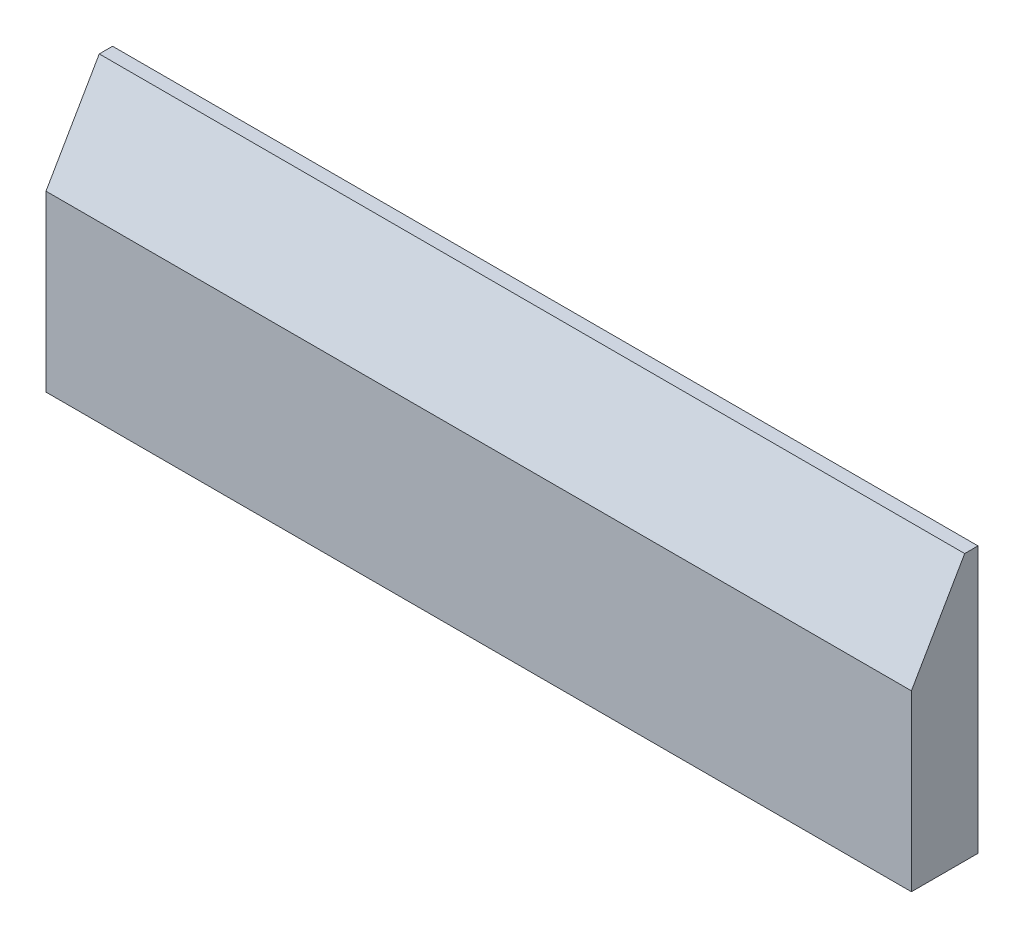
ISO-10303-21;
HEADER;
FILE_DESCRIPTION(('STEP AP214'),'2;1');
FILE_NAME('part.step','',(''),(''),'','','');
FILE_SCHEMA(('AUTOMOTIVE_DESIGN { 1 0 10303 214 1 1 1 1 }'));
ENDSEC;
DATA;
#1=APPLICATION_CONTEXT('core data for automotive mechanical design processes');
#2=APPLICATION_PROTOCOL_DEFINITION('international standard','automotive_design',2000,#1);
#3=PRODUCT_CONTEXT('',#1,'mechanical');
#4=PRODUCT('Part','Part','',(#3));
#5=PRODUCT_RELATED_PRODUCT_CATEGORY('part','',(#4));
#6=PRODUCT_DEFINITION_FORMATION('','',#4);
#7=PRODUCT_DEFINITION_CONTEXT('part definition',#1,'design');
#8=PRODUCT_DEFINITION('design','',#6,#7);
#9=PRODUCT_DEFINITION_SHAPE('','',#8);
#10=(LENGTH_UNIT() NAMED_UNIT(*) SI_UNIT(.MILLI.,.METRE.));
#11=(NAMED_UNIT(*) PLANE_ANGLE_UNIT() SI_UNIT($,.RADIAN.));
#12=(NAMED_UNIT(*) SI_UNIT($,.STERADIAN.) SOLID_ANGLE_UNIT());
#13=UNCERTAINTY_MEASURE_WITH_UNIT(LENGTH_MEASURE(1.E-05),#10,'distance_accuracy_value','');
#14=(GEOMETRIC_REPRESENTATION_CONTEXT(3) GLOBAL_UNCERTAINTY_ASSIGNED_CONTEXT((#13)) GLOBAL_UNIT_ASSIGNED_CONTEXT((#10,
#11,#12)) REPRESENTATION_CONTEXT('',''));
#15=CARTESIAN_POINT('',(0.,0.,0.));
#16=DIRECTION('',(0.,0.,1.));
#17=DIRECTION('',(1.,0.,0.));
#18=AXIS2_PLACEMENT_3D('',#15,#16,#17);
#19=CARTESIAN_POINT('',(0.,0.,6.35));
#20=DIRECTION('',(1.,0.,0.));
#21=DIRECTION('',(0.,0.,-1.));
#22=AXIS2_PLACEMENT_3D('',#19,#20,#21);
#23=PLANE('',#22);
#24=DIRECTION('',(0.,-1.,0.));
#25=VECTOR('',#24,1.);
#26=CARTESIAN_POINT('',(0.,0.,6.35));
#27=LINE('',#26,#25);
#28=CARTESIAN_POINT('',(0.,16.6011818975501,6.35));
#29=VERTEX_POINT('',#28);
#30=CARTESIAN_POINT('',(0.,0.,6.35));
#31=VERTEX_POINT('',#30);
#32=EDGE_CURVE('E77',#29,#31,#27,.T.);
#33=ORIENTED_EDGE('',*,*,#32,.F.);
#34=DIRECTION('',(0.,-0.866025403784438,0.500000000000001));
#35=VECTOR('',#34,1.);
#36=CARTESIAN_POINT('',(0.,16.6011818975501,6.35));
#37=LINE('',#36,#35);
#38=CARTESIAN_POINT('',(0.,25.4,1.26999999999999));
#39=VERTEX_POINT('',#38);
#40=EDGE_CURVE('E55',#29,#39,#37,.F.);
#41=ORIENTED_EDGE('',*,*,#40,.T.);
#42=DIRECTION('',(0.,0.,-1.));
#43=VECTOR('',#42,1.);
#44=CARTESIAN_POINT('',(0.,25.4,6.35));
#45=LINE('',#44,#43);
#46=CARTESIAN_POINT('',(0.,25.4,0.));
#47=VERTEX_POINT('',#46);
#48=EDGE_CURVE('E107',#39,#47,#45,.T.);
#49=ORIENTED_EDGE('',*,*,#48,.T.);
#50=DIRECTION('',(0.,-1.,0.));
#51=VECTOR('',#50,1.);
#52=CARTESIAN_POINT('',(0.,0.,0.));
#53=LINE('',#52,#51);
#54=CARTESIAN_POINT('',(0.,0.,0.));
#55=VERTEX_POINT('',#54);
#56=EDGE_CURVE('E99',#47,#55,#53,.T.);
#57=ORIENTED_EDGE('',*,*,#56,.T.);
#58=DIRECTION('',(0.,0.,-1.));
#59=VECTOR('',#58,1.);
#60=CARTESIAN_POINT('',(0.,0.,6.35));
#61=LINE('',#60,#59);
#62=EDGE_CURVE('E91',#31,#55,#61,.T.);
#63=ORIENTED_EDGE('',*,*,#62,.F.);
#64=EDGE_LOOP('',(#33,#41,#49,#57,#63));
#65=FACE_BOUND('',#64,.T.);
#66=ADVANCED_FACE('F33',(#65),#23,.F.);
#67=CARTESIAN_POINT('',(0.,0.,6.35));
#68=DIRECTION('',(0.,1.,0.));
#69=DIRECTION('',(0.,0.,1.));
#70=AXIS2_PLACEMENT_3D('',#67,#68,#69);
#71=PLANE('',#70);
#72=DIRECTION('',(1.,0.,0.));
#73=VECTOR('',#72,1.);
#74=CARTESIAN_POINT('',(0.,0.,0.));
#75=LINE('',#74,#73);
#76=CARTESIAN_POINT('',(82.55,0.,0.));
#77=VERTEX_POINT('',#76);
#78=EDGE_CURVE('E114',#55,#77,#75,.T.);
#79=ORIENTED_EDGE('',*,*,#78,.T.);
#80=DIRECTION('',(0.,0.,-1.));
#81=VECTOR('',#80,1.);
#82=CARTESIAN_POINT('',(82.55,0.,6.35));
#83=LINE('',#82,#81);
#84=CARTESIAN_POINT('',(82.55,0.,6.35));
#85=VERTEX_POINT('',#84);
#86=EDGE_CURVE('E94',#85,#77,#83,.T.);
#87=ORIENTED_EDGE('',*,*,#86,.F.);
#88=DIRECTION('',(1.,0.,0.));
#89=VECTOR('',#88,1.);
#90=CARTESIAN_POINT('',(0.,0.,6.35));
#91=LINE('',#90,#89);
#92=EDGE_CURVE('E81',#31,#85,#91,.T.);
#93=ORIENTED_EDGE('',*,*,#92,.F.);
#94=ORIENTED_EDGE('',*,*,#62,.T.);
#95=EDGE_LOOP('',(#79,#87,#93,#94));
#96=FACE_BOUND('',#95,.T.);
#97=ADVANCED_FACE('F90',(#96),#71,.F.);
#98=CARTESIAN_POINT('',(82.55,0.,6.35));
#99=DIRECTION('',(-1.,0.,0.));
#100=DIRECTION('',(0.,0.,1.));
#101=AXIS2_PLACEMENT_3D('',#98,#99,#100);
#102=PLANE('',#101);
#103=DIRECTION('',(0.,0.,-1.));
#104=VECTOR('',#103,1.);
#105=CARTESIAN_POINT('',(82.55,25.4,6.35));
#106=LINE('',#105,#104);
#107=CARTESIAN_POINT('',(82.55,25.4,1.26999999999999));
#108=VERTEX_POINT('',#107);
#109=CARTESIAN_POINT('',(82.55,25.4,0.));
#110=VERTEX_POINT('',#109);
#111=EDGE_CURVE('E102',#108,#110,#106,.T.);
#112=ORIENTED_EDGE('',*,*,#111,.F.);
#113=DIRECTION('',(0.,0.866025403784438,-0.500000000000001));
#114=VECTOR('',#113,1.);
#115=CARTESIAN_POINT('',(82.55,16.6011818975501,6.35));
#116=LINE('',#115,#114);
#117=CARTESIAN_POINT('',(82.55,16.6011818975501,6.35));
#118=VERTEX_POINT('',#117);
#119=EDGE_CURVE('E11',#108,#118,#116,.F.);
#120=ORIENTED_EDGE('',*,*,#119,.T.);
#121=DIRECTION('',(0.,1.,0.));
#122=VECTOR('',#121,1.);
#123=CARTESIAN_POINT('',(82.55,0.,6.35));
#124=LINE('',#123,#122);
#125=EDGE_CURVE('E96',#85,#118,#124,.T.);
#126=ORIENTED_EDGE('',*,*,#125,.F.);
#127=ORIENTED_EDGE('',*,*,#86,.T.);
#128=DIRECTION('',(0.,1.,0.));
#129=VECTOR('',#128,1.);
#130=CARTESIAN_POINT('',(82.55,0.,0.));
#131=LINE('',#130,#129);
#132=EDGE_CURVE('E111',#77,#110,#131,.T.);
#133=ORIENTED_EDGE('',*,*,#132,.T.);
#134=EDGE_LOOP('',(#112,#120,#126,#127,#133));
#135=FACE_BOUND('',#134,.T.);
#136=ADVANCED_FACE('F120',(#135),#102,.F.);
#137=CARTESIAN_POINT('',(0.,25.4,6.35));
#138=DIRECTION('',(0.,-1.,0.));
#139=DIRECTION('',(0.,0.,-1.));
#140=AXIS2_PLACEMENT_3D('',#137,#138,#139);
#141=PLANE('',#140);
#142=ORIENTED_EDGE('',*,*,#48,.F.);
#143=DIRECTION('',(1.,0.,0.));
#144=VECTOR('',#143,1.);
#145=CARTESIAN_POINT('',(0.,25.4,1.26999999999999));
#146=LINE('',#145,#144);
#147=EDGE_CURVE('E41',#39,#108,#146,.T.);
#148=ORIENTED_EDGE('',*,*,#147,.T.);
#149=ORIENTED_EDGE('',*,*,#111,.T.);
#150=DIRECTION('',(-1.,0.,0.));
#151=VECTOR('',#150,1.);
#152=CARTESIAN_POINT('',(0.,25.4,0.));
#153=LINE('',#152,#151);
#154=EDGE_CURVE('E86',#110,#47,#153,.T.);
#155=ORIENTED_EDGE('',*,*,#154,.T.);
#156=EDGE_LOOP('',(#142,#148,#149,#155));
#157=FACE_BOUND('',#156,.T.);
#158=ADVANCED_FACE('F123',(#157),#141,.F.);
#159=CARTESIAN_POINT('',(0.,0.,6.35));
#160=DIRECTION('',(0.,0.,-1.));
#161=DIRECTION('',(-1.,0.,0.));
#162=AXIS2_PLACEMENT_3D('',#159,#160,#161);
#163=PLANE('',#162);
#164=ORIENTED_EDGE('',*,*,#125,.T.);
#165=DIRECTION('',(-1.,0.,0.));
#166=VECTOR('',#165,1.);
#167=CARTESIAN_POINT('',(0.,16.6011818975501,6.35));
#168=LINE('',#167,#166);
#169=EDGE_CURVE('E84',#118,#29,#168,.T.);
#170=ORIENTED_EDGE('',*,*,#169,.T.);
#171=ORIENTED_EDGE('',*,*,#32,.T.);
#172=ORIENTED_EDGE('',*,*,#92,.T.);
#173=EDGE_LOOP('',(#164,#170,#171,#172));
#174=FACE_BOUND('',#173,.T.);
#175=ADVANCED_FACE('F80',(#174),#163,.F.);
#176=CARTESIAN_POINT('',(0.,0.,0.));
#177=DIRECTION('',(0.,0.,-1.));
#178=DIRECTION('',(-1.,0.,0.));
#179=AXIS2_PLACEMENT_3D('',#176,#177,#178);
#180=PLANE('',#179);
#181=ORIENTED_EDGE('',*,*,#56,.F.);
#182=ORIENTED_EDGE('',*,*,#154,.F.);
#183=ORIENTED_EDGE('',*,*,#132,.F.);
#184=ORIENTED_EDGE('',*,*,#78,.F.);
#185=EDGE_LOOP('',(#181,#182,#183,#184));
#186=FACE_BOUND('',#185,.T.);
#187=ADVANCED_FACE('F125',(#186),#180,.T.);
#188=CARTESIAN_POINT('',(0.,16.6011818975501,6.35));
#189=DIRECTION('',(0.,-0.500000000000001,-0.866025403784438));
#190=DIRECTION('',(-1.,0.,0.));
#191=AXIS2_PLACEMENT_3D('',#188,#189,#190);
#192=PLANE('',#191);
#193=ORIENTED_EDGE('',*,*,#119,.F.);
#194=ORIENTED_EDGE('',*,*,#147,.F.);
#195=ORIENTED_EDGE('',*,*,#40,.F.);
#196=ORIENTED_EDGE('',*,*,#169,.F.);
#197=EDGE_LOOP('',(#193,#194,#195,#196));
#198=FACE_BOUND('',#197,.T.);
#199=ADVANCED_FACE('F35',(#198),#192,.F.);
#200=CLOSED_SHELL('',(#66,#97,#136,#158,#175,#187,#199));
#201=MANIFOLD_SOLID_BREP('B2',#200);
#202=ADVANCED_BREP_SHAPE_REPRESENTATION('',(#18,#201),#14);
#203=SHAPE_DEFINITION_REPRESENTATION(#9,#202);
ENDSEC;
END-ISO-10303-21;
